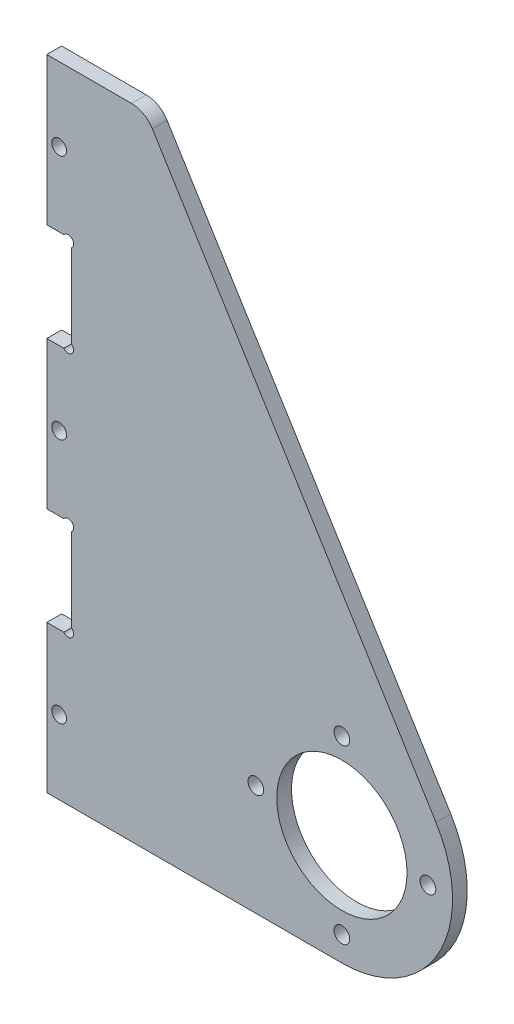
ISO-10303-21;
HEADER;
FILE_DESCRIPTION(('STEP AP214'),'2;1');
FILE_NAME('part.step','',(''),(''),'','','');
FILE_SCHEMA(('AUTOMOTIVE_DESIGN { 1 0 10303 214 1 1 1 1 }'));
ENDSEC;
DATA;
#1=APPLICATION_CONTEXT('core data for automotive mechanical design processes');
#2=APPLICATION_PROTOCOL_DEFINITION('international standard','automotive_design',2000,#1);
#3=PRODUCT_CONTEXT('',#1,'mechanical');
#4=PRODUCT('Part','Part','',(#3));
#5=PRODUCT_RELATED_PRODUCT_CATEGORY('part','',(#4));
#6=PRODUCT_DEFINITION_FORMATION('','',#4);
#7=PRODUCT_DEFINITION_CONTEXT('part definition',#1,'design');
#8=PRODUCT_DEFINITION('design','',#6,#7);
#9=PRODUCT_DEFINITION_SHAPE('','',#8);
#10=(LENGTH_UNIT() NAMED_UNIT(*) SI_UNIT(.MILLI.,.METRE.));
#11=(NAMED_UNIT(*) PLANE_ANGLE_UNIT() SI_UNIT($,.RADIAN.));
#12=(NAMED_UNIT(*) SI_UNIT($,.STERADIAN.) SOLID_ANGLE_UNIT());
#13=UNCERTAINTY_MEASURE_WITH_UNIT(LENGTH_MEASURE(1.E-05),#10,'distance_accuracy_value','');
#14=(GEOMETRIC_REPRESENTATION_CONTEXT(3) GLOBAL_UNCERTAINTY_ASSIGNED_CONTEXT((#13)) GLOBAL_UNIT_ASSIGNED_CONTEXT((#10,
#11,#12)) REPRESENTATION_CONTEXT('',''));
#15=CARTESIAN_POINT('',(0.,0.,0.));
#16=DIRECTION('',(0.,0.,1.));
#17=DIRECTION('',(1.,0.,0.));
#18=AXIS2_PLACEMENT_3D('',#15,#16,#17);
#19=CARTESIAN_POINT('',(-60.,107.5,3.));
#20=DIRECTION('',(1.,0.,0.));
#21=DIRECTION('',(0.,1.,0.));
#22=AXIS2_PLACEMENT_3D('',#19,#20,#21);
#23=PLANE('',#22);
#24=DIRECTION('',(0.,0.,-1.));
#25=VECTOR('',#24,1.);
#26=CARTESIAN_POINT('',(-60.,27.5,3.));
#27=LINE('',#26,#25);
#28=CARTESIAN_POINT('',(-60.,27.5,3.));
#29=VERTEX_POINT('',#28);
#30=CARTESIAN_POINT('',(-60.,27.5,0.));
#31=VERTEX_POINT('',#30);
#32=EDGE_CURVE('E395',#29,#31,#27,.T.);
#33=ORIENTED_EDGE('',*,*,#32,.F.);
#34=DIRECTION('',(0.,-1.,0.));
#35=VECTOR('',#34,1.);
#36=CARTESIAN_POINT('',(-60.,107.5,3.));
#37=LINE('',#36,#35);
#38=CARTESIAN_POINT('',(-60.,57.5,3.));
#39=VERTEX_POINT('',#38);
#40=EDGE_CURVE('E350',#39,#29,#37,.T.);
#41=ORIENTED_EDGE('',*,*,#40,.F.);
#42=DIRECTION('',(0.,0.,-1.));
#43=VECTOR('',#42,1.);
#44=CARTESIAN_POINT('',(-60.,57.5,3.));
#45=LINE('',#44,#43);
#46=CARTESIAN_POINT('',(-60.,57.5,0.));
#47=VERTEX_POINT('',#46);
#48=EDGE_CURVE('E392',#39,#47,#45,.T.);
#49=ORIENTED_EDGE('',*,*,#48,.T.);
#50=DIRECTION('',(0.,-1.,0.));
#51=VECTOR('',#50,1.);
#52=CARTESIAN_POINT('',(-60.,107.5,0.));
#53=LINE('',#52,#51);
#54=EDGE_CURVE('E364',#47,#31,#53,.T.);
#55=ORIENTED_EDGE('',*,*,#54,.T.);
#56=EDGE_LOOP('',(#33,#41,#49,#55));
#57=FACE_BOUND('',#56,.T.);
#58=ADVANCED_FACE('F111',(#57),#23,.F.);
#59=DIRECTION('',(0.,0.,-1.));
#60=VECTOR('',#59,1.);
#61=CARTESIAN_POINT('',(-60.,77.5,3.));
#62=LINE('',#61,#60);
#63=CARTESIAN_POINT('',(-60.,77.5,3.));
#64=VERTEX_POINT('',#63);
#65=CARTESIAN_POINT('',(-60.,77.5,0.));
#66=VERTEX_POINT('',#65);
#67=EDGE_CURVE('E390',#64,#66,#62,.T.);
#68=ORIENTED_EDGE('',*,*,#67,.F.);
#69=CARTESIAN_POINT('',(-60.,107.5,3.));
#70=VERTEX_POINT('',#69);
#71=EDGE_CURVE('E346',#70,#64,#37,.T.);
#72=ORIENTED_EDGE('',*,*,#71,.F.);
#73=DIRECTION('',(0.,0.,-1.));
#74=VECTOR('',#73,1.);
#75=CARTESIAN_POINT('',(-60.,107.5,3.));
#76=LINE('',#75,#74);
#77=CARTESIAN_POINT('',(-60.,107.5,0.));
#78=VERTEX_POINT('',#77);
#79=EDGE_CURVE('E378',#70,#78,#76,.T.);
#80=ORIENTED_EDGE('',*,*,#79,.T.);
#81=EDGE_CURVE('E360',#78,#66,#53,.T.);
#82=ORIENTED_EDGE('',*,*,#81,.T.);
#83=EDGE_LOOP('',(#68,#72,#80,#82));
#84=FACE_BOUND('',#83,.T.);
#85=ADVANCED_FACE('F454',(#84),#23,.F.);
#86=CARTESIAN_POINT('',(0.,0.,3.));
#87=DIRECTION('',(0.,0.,1.));
#88=DIRECTION('',(1.,0.,0.));
#89=AXIS2_PLACEMENT_3D('',#86,#87,#88);
#90=PLANE('',#89);
#91=CARTESIAN_POINT('',(-57.5000000000003,92.5,3.));
#92=DIRECTION('',(0.,0.,1.));
#93=DIRECTION('',(1.,0.,0.));
#94=AXIS2_PLACEMENT_3D('',#91,#92,#93);
#95=CIRCLE('',#94,1.5);
#96=CARTESIAN_POINT('',(-56.0000000000003,92.5,3.));
#97=VERTEX_POINT('',#96);
#98=EDGE_CURVE('E261',#97,#97,#95,.T.);
#99=ORIENTED_EDGE('',*,*,#98,.F.);
#100=EDGE_LOOP('',(#99));
#101=FACE_BOUND('',#100,.T.);
#102=DIRECTION('',(1.,0.,0.));
#103=VECTOR('',#102,1.);
#104=CARTESIAN_POINT('',(-60.,7.5,3.));
#105=LINE('',#104,#103);
#106=CARTESIAN_POINT('',(-60.,7.5,3.));
#107=VERTEX_POINT('',#106);
#108=CARTESIAN_POINT('',(-56.54,7.5,3.));
#109=VERTEX_POINT('',#108);
#110=EDGE_CURVE('E249',#107,#109,#105,.T.);
#111=ORIENTED_EDGE('',*,*,#110,.F.);
#112=CARTESIAN_POINT('',(-60.,-22.5,3.));
#113=VERTEX_POINT('',#112);
#114=EDGE_CURVE('E344',#107,#113,#37,.T.);
#115=ORIENTED_EDGE('',*,*,#114,.T.);
#116=DIRECTION('',(1.,0.,0.));
#117=VECTOR('',#116,1.);
#118=CARTESIAN_POINT('',(-60.,-22.5,3.));
#119=LINE('',#118,#117);
#120=CARTESIAN_POINT('',(0.,-22.5,3.));
#121=VERTEX_POINT('',#120);
#122=EDGE_CURVE('E349',#113,#121,#119,.T.);
#123=ORIENTED_EDGE('',*,*,#122,.T.);
#124=CARTESIAN_POINT('',(0.,0.,3.));
#125=DIRECTION('',(0.,0.,1.));
#126=DIRECTION('',(1.,0.,0.));
#127=AXIS2_PLACEMENT_3D('',#124,#125,#126);
#128=CIRCLE('',#127,22.5);
#129=CARTESIAN_POINT('',(19.1385979441861,11.8306410955111,3.));
#130=VERTEX_POINT('',#129);
#131=EDGE_CURVE('E352',#121,#130,#128,.T.);
#132=ORIENTED_EDGE('',*,*,#131,.T.);
#133=DIRECTION('',(-0.525806270911605,0.850604353074937,0.));
#134=VECTOR('',#133,1.);
#135=CARTESIAN_POINT('',(-40.,107.5,3.));
#136=LINE('',#135,#134);
#137=CARTESIAN_POINT('',(-38.5343712650876,105.129031354558,3.));
#138=VERTEX_POINT('',#137);
#139=EDGE_CURVE('E354',#130,#138,#136,.T.);
#140=ORIENTED_EDGE('',*,*,#139,.T.);
#141=CARTESIAN_POINT('',(-42.7873930304623,102.5,3.));
#142=DIRECTION('',(0.,0.,1.));
#143=DIRECTION('',(1.,0.,0.));
#144=AXIS2_PLACEMENT_3D('',#141,#142,#143);
#145=CIRCLE('',#144,5.);
#146=CARTESIAN_POINT('',(-42.7873930304623,107.5,3.));
#147=VERTEX_POINT('',#146);
#148=EDGE_CURVE('E388',#138,#147,#145,.T.);
#149=ORIENTED_EDGE('',*,*,#148,.T.);
#150=DIRECTION('',(-1.,0.,0.));
#151=VECTOR('',#150,1.);
#152=CARTESIAN_POINT('',(-60.,107.5,3.));
#153=LINE('',#152,#151);
#154=EDGE_CURVE('E342',#147,#70,#153,.T.);
#155=ORIENTED_EDGE('',*,*,#154,.T.);
#156=ORIENTED_EDGE('',*,*,#71,.T.);
#157=DIRECTION('',(1.,0.,0.));
#158=VECTOR('',#157,1.);
#159=CARTESIAN_POINT('',(0.,77.5,3.));
#160=LINE('',#159,#158);
#161=CARTESIAN_POINT('',(-56.5400000000002,77.5,3.));
#162=VERTEX_POINT('',#161);
#163=EDGE_CURVE('E135',#64,#162,#160,.T.);
#164=ORIENTED_EDGE('',*,*,#163,.T.);
#165=CARTESIAN_POINT('',(-55.6600000000002,76.84,3.));
#166=DIRECTION('',(0.,0.,1.));
#167=DIRECTION('',(1.,0.,0.));
#168=AXIS2_PLACEMENT_3D('',#165,#166,#167);
#169=CIRCLE('',#168,1.10000000000001);
#170=CARTESIAN_POINT('',(-55.,75.9600000000001,3.));
#171=VERTEX_POINT('',#170);
#172=EDGE_CURVE('E284',#171,#162,#169,.T.);
#173=ORIENTED_EDGE('',*,*,#172,.F.);
#174=DIRECTION('',(0.,-1.,0.));
#175=VECTOR('',#174,1.);
#176=CARTESIAN_POINT('',(-55.,0.,3.));
#177=LINE('',#176,#175);
#178=CARTESIAN_POINT('',(-55.,59.04,3.));
#179=VERTEX_POINT('',#178);
#180=EDGE_CURVE('E289',#171,#179,#177,.T.);
#181=ORIENTED_EDGE('',*,*,#180,.T.);
#182=CARTESIAN_POINT('',(-55.6600000000001,58.16,3.));
#183=DIRECTION('',(0.,0.,1.));
#184=DIRECTION('',(1.,0.,0.));
#185=AXIS2_PLACEMENT_3D('',#182,#183,#184);
#186=CIRCLE('',#185,1.10000000000001);
#187=CARTESIAN_POINT('',(-56.5400000000001,57.5,3.));
#188=VERTEX_POINT('',#187);
#189=EDGE_CURVE('E281',#188,#179,#186,.T.);
#190=ORIENTED_EDGE('',*,*,#189,.F.);
#191=DIRECTION('',(1.,0.,0.));
#192=VECTOR('',#191,1.);
#193=CARTESIAN_POINT('',(0.,57.5,3.));
#194=LINE('',#193,#192);
#195=EDGE_CURVE('E298',#39,#188,#194,.T.);
#196=ORIENTED_EDGE('',*,*,#195,.F.);
#197=ORIENTED_EDGE('',*,*,#40,.T.);
#198=DIRECTION('',(1.,0.,0.));
#199=VECTOR('',#198,1.);
#200=CARTESIAN_POINT('',(-60.,27.5,3.));
#201=LINE('',#200,#199);
#202=CARTESIAN_POINT('',(-56.54,27.5,3.));
#203=VERTEX_POINT('',#202);
#204=EDGE_CURVE('E127',#29,#203,#201,.T.);
#205=ORIENTED_EDGE('',*,*,#204,.T.);
#206=CARTESIAN_POINT('',(-55.66,26.84,3.));
#207=DIRECTION('',(0.,0.,1.));
#208=DIRECTION('',(1.,0.,0.));
#209=AXIS2_PLACEMENT_3D('',#206,#207,#208);
#210=CIRCLE('',#209,1.1);
#211=CARTESIAN_POINT('',(-55.,25.96,3.));
#212=VERTEX_POINT('',#211);
#213=EDGE_CURVE('E270',#212,#203,#210,.T.);
#214=ORIENTED_EDGE('',*,*,#213,.F.);
#215=DIRECTION('',(0.,-1.,0.));
#216=VECTOR('',#215,1.);
#217=CARTESIAN_POINT('',(-55.,27.5,3.));
#218=LINE('',#217,#216);
#219=CARTESIAN_POINT('',(-55.,9.03999999999999,3.));
#220=VERTEX_POINT('',#219);
#221=EDGE_CURVE('E255',#212,#220,#218,.T.);
#222=ORIENTED_EDGE('',*,*,#221,.T.);
#223=CARTESIAN_POINT('',(-55.66,8.16,3.));
#224=DIRECTION('',(0.,0.,1.));
#225=DIRECTION('',(1.,0.,0.));
#226=AXIS2_PLACEMENT_3D('',#223,#224,#225);
#227=CIRCLE('',#226,1.1);
#228=EDGE_CURVE('E242',#109,#220,#227,.T.);
#229=ORIENTED_EDGE('',*,*,#228,.F.);
#230=EDGE_LOOP('',(#111,#115,#123,#132,#140,#149,#155,#156,#164,#173,#181,#190,#196,#197,#205,
#214,#222,#229));
#231=FACE_BOUND('',#230,.T.);
#232=CARTESIAN_POINT('',(-57.5,-7.50000000000001,3.));
#233=DIRECTION('',(0.,0.,1.));
#234=DIRECTION('',(1.,0.,0.));
#235=AXIS2_PLACEMENT_3D('',#232,#233,#234);
#236=CIRCLE('',#235,1.5);
#237=CARTESIAN_POINT('',(-56.,-7.50000000000001,3.));
#238=VERTEX_POINT('',#237);
#239=EDGE_CURVE('E274',#238,#238,#236,.T.);
#240=ORIENTED_EDGE('',*,*,#239,.F.);
#241=EDGE_LOOP('',(#240));
#242=FACE_BOUND('',#241,.T.);
#243=CARTESIAN_POINT('',(-57.5000000000002,42.5,3.));
#244=DIRECTION('',(0.,0.,1.));
#245=DIRECTION('',(1.,0.,0.));
#246=AXIS2_PLACEMENT_3D('',#243,#244,#245);
#247=CIRCLE('',#246,1.5);
#248=CARTESIAN_POINT('',(-56.0000000000002,42.5,3.));
#249=VERTEX_POINT('',#248);
#250=EDGE_CURVE('E278',#249,#249,#247,.T.);
#251=ORIENTED_EDGE('',*,*,#250,.F.);
#252=EDGE_LOOP('',(#251));
#253=FACE_BOUND('',#252,.T.);
#254=CARTESIAN_POINT('',(0.,-17.5,3.));
#255=DIRECTION('',(0.,0.,1.));
#256=DIRECTION('',(1.,0.,0.));
#257=AXIS2_PLACEMENT_3D('',#254,#255,#256);
#258=CIRCLE('',#257,1.6);
#259=CARTESIAN_POINT('',(1.59999999999994,-17.5,3.));
#260=VERTEX_POINT('',#259);
#261=EDGE_CURVE('E318',#260,#260,#258,.T.);
#262=ORIENTED_EDGE('',*,*,#261,.F.);
#263=EDGE_LOOP('',(#262));
#264=FACE_BOUND('',#263,.T.);
#265=CARTESIAN_POINT('',(0.,17.5,3.));
#266=DIRECTION('',(0.,0.,1.));
#267=DIRECTION('',(1.,0.,0.));
#268=AXIS2_PLACEMENT_3D('',#265,#266,#267);
#269=CIRCLE('',#268,1.6);
#270=CARTESIAN_POINT('',(1.60000000000005,17.5,3.));
#271=VERTEX_POINT('',#270);
#272=EDGE_CURVE('E330',#271,#271,#269,.T.);
#273=ORIENTED_EDGE('',*,*,#272,.F.);
#274=EDGE_LOOP('',(#273));
#275=FACE_BOUND('',#274,.T.);
#276=CARTESIAN_POINT('',(0.,0.,3.));
#277=DIRECTION('',(0.,0.,1.));
#278=DIRECTION('',(1.,0.,0.));
#279=AXIS2_PLACEMENT_3D('',#276,#277,#278);
#280=CIRCLE('',#279,13.25);
#281=CARTESIAN_POINT('',(13.25,0.,3.));
#282=VERTEX_POINT('',#281);
#283=EDGE_CURVE('E336',#282,#282,#280,.T.);
#284=ORIENTED_EDGE('',*,*,#283,.F.);
#285=EDGE_LOOP('',(#284));
#286=FACE_BOUND('',#285,.T.);
#287=CARTESIAN_POINT('',(17.5,0.,3.));
#288=DIRECTION('',(0.,0.,1.));
#289=DIRECTION('',(1.,0.,0.));
#290=AXIS2_PLACEMENT_3D('',#287,#288,#289);
#291=CIRCLE('',#290,1.60000000000001);
#292=CARTESIAN_POINT('',(19.1,0.,3.));
#293=VERTEX_POINT('',#292);
#294=EDGE_CURVE('E324',#293,#293,#291,.T.);
#295=ORIENTED_EDGE('',*,*,#294,.F.);
#296=EDGE_LOOP('',(#295));
#297=FACE_BOUND('',#296,.T.);
#298=CARTESIAN_POINT('',(-17.5,0.,3.));
#299=DIRECTION('',(0.,0.,1.));
#300=DIRECTION('',(1.,0.,0.));
#301=AXIS2_PLACEMENT_3D('',#298,#299,#300);
#302=CIRCLE('',#301,1.6);
#303=CARTESIAN_POINT('',(-15.9,0.,3.));
#304=VERTEX_POINT('',#303);
#305=EDGE_CURVE('E311',#304,#304,#302,.T.);
#306=ORIENTED_EDGE('',*,*,#305,.F.);
#307=EDGE_LOOP('',(#306));
#308=FACE_BOUND('',#307,.T.);
#309=ADVANCED_FACE('F257',(#101,#231,#242,#253,#264,#275,#286,#297,#308),#90,.T.);
#310=CARTESIAN_POINT('',(0.,0.,0.));
#311=DIRECTION('',(0.,0.,1.));
#312=DIRECTION('',(1.,0.,0.));
#313=AXIS2_PLACEMENT_3D('',#310,#311,#312);
#314=PLANE('',#313);
#315=CARTESIAN_POINT('',(-57.5000000000003,92.5,0.));
#316=DIRECTION('',(0.,0.,1.));
#317=DIRECTION('',(1.,0.,0.));
#318=AXIS2_PLACEMENT_3D('',#315,#316,#317);
#319=CIRCLE('',#318,1.5);
#320=CARTESIAN_POINT('',(-56.0000000000003,92.5,0.));
#321=VERTEX_POINT('',#320);
#322=EDGE_CURVE('E115',#321,#321,#319,.T.);
#323=ORIENTED_EDGE('',*,*,#322,.T.);
#324=EDGE_LOOP('',(#323));
#325=FACE_BOUND('',#324,.T.);
#326=CARTESIAN_POINT('',(-57.5,-7.50000000000001,0.));
#327=DIRECTION('',(0.,0.,1.));
#328=DIRECTION('',(1.,0.,0.));
#329=AXIS2_PLACEMENT_3D('',#326,#327,#328);
#330=CIRCLE('',#329,1.5);
#331=CARTESIAN_POINT('',(-56.,-7.50000000000001,0.));
#332=VERTEX_POINT('',#331);
#333=EDGE_CURVE('E409',#332,#332,#330,.T.);
#334=ORIENTED_EDGE('',*,*,#333,.T.);
#335=EDGE_LOOP('',(#334));
#336=FACE_BOUND('',#335,.T.);
#337=CARTESIAN_POINT('',(-57.5000000000002,42.5,0.));
#338=DIRECTION('',(0.,0.,1.));
#339=DIRECTION('',(1.,0.,0.));
#340=AXIS2_PLACEMENT_3D('',#337,#338,#339);
#341=CIRCLE('',#340,1.5);
#342=CARTESIAN_POINT('',(-56.0000000000002,42.5,0.));
#343=VERTEX_POINT('',#342);
#344=EDGE_CURVE('E310',#343,#343,#341,.T.);
#345=ORIENTED_EDGE('',*,*,#344,.T.);
#346=EDGE_LOOP('',(#345));
#347=FACE_BOUND('',#346,.T.);
#348=CARTESIAN_POINT('',(-60.,7.5,0.));
#349=VERTEX_POINT('',#348);
#350=CARTESIAN_POINT('',(-60.,-22.5,0.));
#351=VERTEX_POINT('',#350);
#352=EDGE_CURVE('E359',#349,#351,#53,.T.);
#353=ORIENTED_EDGE('',*,*,#352,.F.);
#354=DIRECTION('',(1.,0.,0.));
#355=VECTOR('',#354,1.);
#356=CARTESIAN_POINT('',(0.,7.50000000000004,0.));
#357=LINE('',#356,#355);
#358=CARTESIAN_POINT('',(-56.54,7.5,0.));
#359=VERTEX_POINT('',#358);
#360=EDGE_CURVE('E308',#349,#359,#357,.T.);
#361=ORIENTED_EDGE('',*,*,#360,.T.);
#362=CARTESIAN_POINT('',(-55.66,8.16,0.));
#363=DIRECTION('',(0.,0.,1.));
#364=DIRECTION('',(1.,0.,0.));
#365=AXIS2_PLACEMENT_3D('',#362,#363,#364);
#366=CIRCLE('',#365,1.1);
#367=CARTESIAN_POINT('',(-55.,9.03999999999999,0.));
#368=VERTEX_POINT('',#367);
#369=EDGE_CURVE('E12',#359,#368,#366,.T.);
#370=ORIENTED_EDGE('',*,*,#369,.T.);
#371=DIRECTION('',(0.,-1.,0.));
#372=VECTOR('',#371,1.);
#373=CARTESIAN_POINT('',(-55.,0.,0.));
#374=LINE('',#373,#372);
#375=CARTESIAN_POINT('',(-55.,25.96,0.));
#376=VERTEX_POINT('',#375);
#377=EDGE_CURVE('E120',#376,#368,#374,.T.);
#378=ORIENTED_EDGE('',*,*,#377,.F.);
#379=CARTESIAN_POINT('',(-55.66,26.84,0.));
#380=DIRECTION('',(0.,0.,1.));
#381=DIRECTION('',(1.,0.,0.));
#382=AXIS2_PLACEMENT_3D('',#379,#380,#381);
#383=CIRCLE('',#382,1.1);
#384=CARTESIAN_POINT('',(-56.54,27.5,0.));
#385=VERTEX_POINT('',#384);
#386=EDGE_CURVE('E406',#376,#385,#383,.T.);
#387=ORIENTED_EDGE('',*,*,#386,.T.);
#388=DIRECTION('',(1.,0.,0.));
#389=VECTOR('',#388,1.);
#390=CARTESIAN_POINT('',(0.,27.5,0.));
#391=LINE('',#390,#389);
#392=EDGE_CURVE('E306',#31,#385,#391,.T.);
#393=ORIENTED_EDGE('',*,*,#392,.F.);
#394=ORIENTED_EDGE('',*,*,#54,.F.);
#395=DIRECTION('',(1.,0.,0.));
#396=VECTOR('',#395,1.);
#397=CARTESIAN_POINT('',(0.,57.5,0.));
#398=LINE('',#397,#396);
#399=CARTESIAN_POINT('',(-56.5400000000001,57.5,0.));
#400=VERTEX_POINT('',#399);
#401=EDGE_CURVE('E303',#47,#400,#398,.T.);
#402=ORIENTED_EDGE('',*,*,#401,.T.);
#403=CARTESIAN_POINT('',(-55.6600000000001,58.16,0.));
#404=DIRECTION('',(0.,0.,1.));
#405=DIRECTION('',(1.,0.,0.));
#406=AXIS2_PLACEMENT_3D('',#403,#404,#405);
#407=CIRCLE('',#406,1.10000000000001);
#408=CARTESIAN_POINT('',(-55.,59.04,0.));
#409=VERTEX_POINT('',#408);
#410=EDGE_CURVE('E403',#400,#409,#407,.T.);
#411=ORIENTED_EDGE('',*,*,#410,.T.);
#412=DIRECTION('',(0.,-1.,0.));
#413=VECTOR('',#412,1.);
#414=CARTESIAN_POINT('',(-55.,0.,0.));
#415=LINE('',#414,#413);
#416=CARTESIAN_POINT('',(-55.,75.9600000000001,0.));
#417=VERTEX_POINT('',#416);
#418=EDGE_CURVE('E401',#417,#409,#415,.T.);
#419=ORIENTED_EDGE('',*,*,#418,.F.);
#420=CARTESIAN_POINT('',(-55.6600000000002,76.84,0.));
#421=DIRECTION('',(0.,0.,1.));
#422=DIRECTION('',(1.,0.,0.));
#423=AXIS2_PLACEMENT_3D('',#420,#421,#422);
#424=CIRCLE('',#423,1.10000000000001);
#425=CARTESIAN_POINT('',(-56.5400000000002,77.5,0.));
#426=VERTEX_POINT('',#425);
#427=EDGE_CURVE('E398',#417,#426,#424,.T.);
#428=ORIENTED_EDGE('',*,*,#427,.T.);
#429=DIRECTION('',(1.,0.,0.));
#430=VECTOR('',#429,1.);
#431=CARTESIAN_POINT('',(0.,77.5,0.));
#432=LINE('',#431,#430);
#433=EDGE_CURVE('E264',#66,#426,#432,.T.);
#434=ORIENTED_EDGE('',*,*,#433,.F.);
#435=ORIENTED_EDGE('',*,*,#81,.F.);
#436=DIRECTION('',(-1.,0.,0.));
#437=VECTOR('',#436,1.);
#438=CARTESIAN_POINT('',(-60.,107.5,0.));
#439=LINE('',#438,#437);
#440=CARTESIAN_POINT('',(-42.7873930304623,107.5,0.));
#441=VERTEX_POINT('',#440);
#442=EDGE_CURVE('E339',#441,#78,#439,.T.);
#443=ORIENTED_EDGE('',*,*,#442,.F.);
#444=CARTESIAN_POINT('',(-42.7873930304623,102.5,0.));
#445=DIRECTION('',(0.,0.,1.));
#446=DIRECTION('',(1.,0.,0.));
#447=AXIS2_PLACEMENT_3D('',#444,#445,#446);
#448=CIRCLE('',#447,5.);
#449=CARTESIAN_POINT('',(-38.5343712650876,105.129031354558,0.));
#450=VERTEX_POINT('',#449);
#451=EDGE_CURVE('E384',#441,#450,#448,.F.);
#452=ORIENTED_EDGE('',*,*,#451,.T.);
#453=DIRECTION('',(-0.525806270911605,0.850604353074937,0.));
#454=VECTOR('',#453,1.);
#455=CARTESIAN_POINT('',(-40.,107.5,0.));
#456=LINE('',#455,#454);
#457=CARTESIAN_POINT('',(19.1385979441861,11.8306410955111,0.));
#458=VERTEX_POINT('',#457);
#459=EDGE_CURVE('E345',#458,#450,#456,.T.);
#460=ORIENTED_EDGE('',*,*,#459,.F.);
#461=CARTESIAN_POINT('',(0.,0.,0.));
#462=DIRECTION('',(0.,0.,1.));
#463=DIRECTION('',(1.,0.,0.));
#464=AXIS2_PLACEMENT_3D('',#461,#462,#463);
#465=CIRCLE('',#464,22.5);
#466=CARTESIAN_POINT('',(0.,-22.5,0.));
#467=VERTEX_POINT('',#466);
#468=EDGE_CURVE('E366',#467,#458,#465,.T.);
#469=ORIENTED_EDGE('',*,*,#468,.F.);
#470=DIRECTION('',(1.,0.,0.));
#471=VECTOR('',#470,1.);
#472=CARTESIAN_POINT('',(-40.,-22.5,0.));
#473=LINE('',#472,#471);
#474=EDGE_CURVE('E363',#351,#467,#473,.T.);
#475=ORIENTED_EDGE('',*,*,#474,.F.);
#476=EDGE_LOOP('',(#353,#361,#370,#378,#387,#393,#394,#402,#411,#419,#428,#434,#435,#443,#452,
#460,#469,#475));
#477=FACE_BOUND('',#476,.T.);
#478=CARTESIAN_POINT('',(0.,0.,0.));
#479=DIRECTION('',(0.,0.,1.));
#480=DIRECTION('',(1.,0.,0.));
#481=AXIS2_PLACEMENT_3D('',#478,#479,#480);
#482=CIRCLE('',#481,13.25);
#483=CARTESIAN_POINT('',(13.25,0.,0.));
#484=VERTEX_POINT('',#483);
#485=EDGE_CURVE('E333',#484,#484,#482,.T.);
#486=ORIENTED_EDGE('',*,*,#485,.T.);
#487=EDGE_LOOP('',(#486));
#488=FACE_BOUND('',#487,.T.);
#489=CARTESIAN_POINT('',(0.,17.5,0.));
#490=DIRECTION('',(0.,0.,1.));
#491=DIRECTION('',(1.,0.,0.));
#492=AXIS2_PLACEMENT_3D('',#489,#490,#491);
#493=CIRCLE('',#492,1.6);
#494=CARTESIAN_POINT('',(1.60000000000005,17.5,0.));
#495=VERTEX_POINT('',#494);
#496=EDGE_CURVE('E327',#495,#495,#493,.T.);
#497=ORIENTED_EDGE('',*,*,#496,.T.);
#498=EDGE_LOOP('',(#497));
#499=FACE_BOUND('',#498,.T.);
#500=CARTESIAN_POINT('',(17.5,0.,0.));
#501=DIRECTION('',(0.,0.,1.));
#502=DIRECTION('',(1.,0.,0.));
#503=AXIS2_PLACEMENT_3D('',#500,#501,#502);
#504=CIRCLE('',#503,1.60000000000001);
#505=CARTESIAN_POINT('',(19.1,0.,0.));
#506=VERTEX_POINT('',#505);
#507=EDGE_CURVE('E321',#506,#506,#504,.T.);
#508=ORIENTED_EDGE('',*,*,#507,.T.);
#509=EDGE_LOOP('',(#508));
#510=FACE_BOUND('',#509,.T.);
#511=CARTESIAN_POINT('',(0.,-17.5,0.));
#512=DIRECTION('',(0.,0.,1.));
#513=DIRECTION('',(1.,0.,0.));
#514=AXIS2_PLACEMENT_3D('',#511,#512,#513);
#515=CIRCLE('',#514,1.6);
#516=CARTESIAN_POINT('',(1.59999999999994,-17.5,0.));
#517=VERTEX_POINT('',#516);
#518=EDGE_CURVE('E314',#517,#517,#515,.T.);
#519=ORIENTED_EDGE('',*,*,#518,.T.);
#520=EDGE_LOOP('',(#519));
#521=FACE_BOUND('',#520,.T.);
#522=CARTESIAN_POINT('',(-17.5,0.,0.));
#523=DIRECTION('',(0.,0.,1.));
#524=DIRECTION('',(1.,0.,0.));
#525=AXIS2_PLACEMENT_3D('',#522,#523,#524);
#526=CIRCLE('',#525,1.6);
#527=CARTESIAN_POINT('',(-15.9,0.,0.));
#528=VERTEX_POINT('',#527);
#529=EDGE_CURVE('E315',#528,#528,#526,.T.);
#530=ORIENTED_EDGE('',*,*,#529,.T.);
#531=EDGE_LOOP('',(#530));
#532=FACE_BOUND('',#531,.T.);
#533=ADVANCED_FACE('F420',(#325,#336,#347,#477,#488,#499,#510,#521,#532),#314,.F.);
#534=CARTESIAN_POINT('',(-60.,107.5,3.));
#535=DIRECTION('',(0.,-1.,0.));
#536=DIRECTION('',(0.,0.,-1.));
#537=AXIS2_PLACEMENT_3D('',#534,#535,#536);
#538=PLANE('',#537);
#539=ORIENTED_EDGE('',*,*,#154,.F.);
#540=DIRECTION('',(0.,0.,-1.));
#541=VECTOR('',#540,1.);
#542=CARTESIAN_POINT('',(-42.7873930304623,107.5,3.));
#543=LINE('',#542,#541);
#544=EDGE_CURVE('E381',#147,#441,#543,.T.);
#545=ORIENTED_EDGE('',*,*,#544,.T.);
#546=ORIENTED_EDGE('',*,*,#442,.T.);
#547=ORIENTED_EDGE('',*,*,#79,.F.);
#548=EDGE_LOOP('',(#539,#545,#546,#547));
#549=FACE_BOUND('',#548,.T.);
#550=ADVANCED_FACE('F464',(#549),#538,.F.);
#551=ORIENTED_EDGE('',*,*,#114,.F.);
#552=DIRECTION('',(0.,0.,-1.));
#553=VECTOR('',#552,1.);
#554=CARTESIAN_POINT('',(-60.,7.50000000000001,3.));
#555=LINE('',#554,#553);
#556=EDGE_CURVE('E252',#107,#349,#555,.T.);
#557=ORIENTED_EDGE('',*,*,#556,.T.);
#558=ORIENTED_EDGE('',*,*,#352,.T.);
#559=DIRECTION('',(0.,0.,-1.));
#560=VECTOR('',#559,1.);
#561=CARTESIAN_POINT('',(-60.,-22.5,3.));
#562=LINE('',#561,#560);
#563=EDGE_CURVE('E375',#113,#351,#562,.T.);
#564=ORIENTED_EDGE('',*,*,#563,.F.);
#565=EDGE_LOOP('',(#551,#557,#558,#564));
#566=FACE_BOUND('',#565,.T.);
#567=ADVANCED_FACE('F424',(#566),#23,.F.);
#568=CARTESIAN_POINT('',(-40.,-22.5,3.));
#569=DIRECTION('',(0.,1.,0.));
#570=DIRECTION('',(0.,0.,1.));
#571=AXIS2_PLACEMENT_3D('',#568,#569,#570);
#572=PLANE('',#571);
#573=ORIENTED_EDGE('',*,*,#474,.T.);
#574=DIRECTION('',(0.,0.,-1.));
#575=VECTOR('',#574,1.);
#576=CARTESIAN_POINT('',(0.,-22.5,3.));
#577=LINE('',#576,#575);
#578=EDGE_CURVE('E372',#121,#467,#577,.T.);
#579=ORIENTED_EDGE('',*,*,#578,.F.);
#580=ORIENTED_EDGE('',*,*,#122,.F.);
#581=ORIENTED_EDGE('',*,*,#563,.T.);
#582=EDGE_LOOP('',(#573,#579,#580,#581));
#583=FACE_BOUND('',#582,.T.);
#584=ADVANCED_FACE('F463',(#583),#572,.F.);
#585=CARTESIAN_POINT('',(0.,0.,3.));
#586=DIRECTION('',(0.,0.,-1.));
#587=DIRECTION('',(-1.,0.,0.));
#588=AXIS2_PLACEMENT_3D('',#585,#586,#587);
#589=CYLINDRICAL_SURFACE('',#588,22.5);
#590=ORIENTED_EDGE('',*,*,#468,.T.);
#591=DIRECTION('',(0.,0.,-1.));
#592=VECTOR('',#591,1.);
#593=CARTESIAN_POINT('',(19.1385979441861,11.8306410955111,3.));
#594=LINE('',#593,#592);
#595=EDGE_CURVE('E357',#130,#458,#594,.T.);
#596=ORIENTED_EDGE('',*,*,#595,.F.);
#597=ORIENTED_EDGE('',*,*,#131,.F.);
#598=ORIENTED_EDGE('',*,*,#578,.T.);
#599=EDGE_LOOP('',(#590,#596,#597,#598));
#600=FACE_BOUND('',#599,.T.);
#601=ADVANCED_FACE('F470',(#600),#589,.T.);
#602=CARTESIAN_POINT('',(-40.,107.5,3.));
#603=DIRECTION('',(-0.850604353074937,-0.525806270911604,0.));
#604=DIRECTION('',(0.525806270911605,-0.850604353074937,0.));
#605=AXIS2_PLACEMENT_3D('',#602,#603,#604);
#606=PLANE('',#605);
#607=ORIENTED_EDGE('',*,*,#459,.T.);
#608=DIRECTION('',(0.,0.,-1.));
#609=VECTOR('',#608,1.);
#610=CARTESIAN_POINT('',(-38.5343712650876,105.129031354558,3.));
#611=LINE('',#610,#609);
#612=EDGE_CURVE('E386',#450,#138,#611,.F.);
#613=ORIENTED_EDGE('',*,*,#612,.T.);
#614=ORIENTED_EDGE('',*,*,#139,.F.);
#615=ORIENTED_EDGE('',*,*,#595,.T.);
#616=EDGE_LOOP('',(#607,#613,#614,#615));
#617=FACE_BOUND('',#616,.T.);
#618=ADVANCED_FACE('F492',(#617),#606,.F.);
#619=CARTESIAN_POINT('',(0.,0.,3.));
#620=DIRECTION('',(0.,0.,-1.));
#621=DIRECTION('',(-1.,0.,0.));
#622=AXIS2_PLACEMENT_3D('',#619,#620,#621);
#623=CYLINDRICAL_SURFACE('',#622,13.25);
#624=ORIENTED_EDGE('',*,*,#283,.T.);
#625=EDGE_LOOP('',(#624));
#626=FACE_BOUND('',#625,.T.);
#627=ORIENTED_EDGE('',*,*,#485,.F.);
#628=EDGE_LOOP('',(#627));
#629=FACE_BOUND('',#628,.T.);
#630=ADVANCED_FACE('F503',(#626,#629),#623,.F.);
#631=CARTESIAN_POINT('',(0.,17.5,3.));
#632=DIRECTION('',(0.,0.,-1.));
#633=DIRECTION('',(-1.,0.,0.));
#634=AXIS2_PLACEMENT_3D('',#631,#632,#633);
#635=CYLINDRICAL_SURFACE('',#634,1.6);
#636=ORIENTED_EDGE('',*,*,#272,.T.);
#637=EDGE_LOOP('',(#636));
#638=FACE_BOUND('',#637,.T.);
#639=ORIENTED_EDGE('',*,*,#496,.F.);
#640=EDGE_LOOP('',(#639));
#641=FACE_BOUND('',#640,.T.);
#642=ADVANCED_FACE('F510',(#638,#641),#635,.F.);
#643=CARTESIAN_POINT('',(17.5,0.,3.));
#644=DIRECTION('',(0.,0.,-1.));
#645=DIRECTION('',(-1.,0.,0.));
#646=AXIS2_PLACEMENT_3D('',#643,#644,#645);
#647=CYLINDRICAL_SURFACE('',#646,1.60000000000001);
#648=ORIENTED_EDGE('',*,*,#294,.T.);
#649=EDGE_LOOP('',(#648));
#650=FACE_BOUND('',#649,.T.);
#651=ORIENTED_EDGE('',*,*,#507,.F.);
#652=EDGE_LOOP('',(#651));
#653=FACE_BOUND('',#652,.T.);
#654=ADVANCED_FACE('F514',(#650,#653),#647,.F.);
#655=CARTESIAN_POINT('',(0.,-17.5,3.));
#656=DIRECTION('',(0.,0.,-1.));
#657=DIRECTION('',(-1.,0.,0.));
#658=AXIS2_PLACEMENT_3D('',#655,#656,#657);
#659=CYLINDRICAL_SURFACE('',#658,1.6);
#660=ORIENTED_EDGE('',*,*,#261,.T.);
#661=EDGE_LOOP('',(#660));
#662=FACE_BOUND('',#661,.T.);
#663=ORIENTED_EDGE('',*,*,#518,.F.);
#664=EDGE_LOOP('',(#663));
#665=FACE_BOUND('',#664,.T.);
#666=ADVANCED_FACE('F518',(#662,#665),#659,.F.);
#667=CARTESIAN_POINT('',(-17.5,0.,3.));
#668=DIRECTION('',(0.,0.,-1.));
#669=DIRECTION('',(-1.,0.,0.));
#670=AXIS2_PLACEMENT_3D('',#667,#668,#669);
#671=CYLINDRICAL_SURFACE('',#670,1.6);
#672=ORIENTED_EDGE('',*,*,#305,.T.);
#673=EDGE_LOOP('',(#672));
#674=FACE_BOUND('',#673,.T.);
#675=ORIENTED_EDGE('',*,*,#529,.F.);
#676=EDGE_LOOP('',(#675));
#677=FACE_BOUND('',#676,.T.);
#678=ADVANCED_FACE('F522',(#674,#677),#671,.F.);
#679=CARTESIAN_POINT('',(-42.7873930304623,102.5,3.));
#680=DIRECTION('',(0.,0.,-1.));
#681=DIRECTION('',(-1.,0.,0.));
#682=AXIS2_PLACEMENT_3D('',#679,#680,#681);
#683=CYLINDRICAL_SURFACE('',#682,5.);
#684=ORIENTED_EDGE('',*,*,#148,.F.);
#685=ORIENTED_EDGE('',*,*,#612,.F.);
#686=ORIENTED_EDGE('',*,*,#451,.F.);
#687=ORIENTED_EDGE('',*,*,#544,.F.);
#688=EDGE_LOOP('',(#684,#685,#686,#687));
#689=FACE_BOUND('',#688,.T.);
#690=ADVANCED_FACE('F113',(#689),#683,.T.);
#691=CARTESIAN_POINT('',(-55.,0.,-7.));
#692=DIRECTION('',(-1.,0.,0.));
#693=DIRECTION('',(0.,-1.,0.));
#694=AXIS2_PLACEMENT_3D('',#691,#692,#693);
#695=PLANE('',#694);
#696=ORIENTED_EDGE('',*,*,#418,.T.);
#697=DIRECTION('',(0.,0.,1.));
#698=VECTOR('',#697,1.);
#699=CARTESIAN_POINT('',(-55.,59.04,-7.));
#700=LINE('',#699,#698);
#701=EDGE_CURVE('E292',#409,#179,#700,.T.);
#702=ORIENTED_EDGE('',*,*,#701,.T.);
#703=ORIENTED_EDGE('',*,*,#180,.F.);
#704=DIRECTION('',(0.,0.,1.));
#705=VECTOR('',#704,1.);
#706=CARTESIAN_POINT('',(-55.,75.9600000000001,-7.));
#707=LINE('',#706,#705);
#708=EDGE_CURVE('E294',#417,#171,#707,.T.);
#709=ORIENTED_EDGE('',*,*,#708,.F.);
#710=EDGE_LOOP('',(#696,#702,#703,#709));
#711=FACE_BOUND('',#710,.T.);
#712=ADVANCED_FACE('F526',(#711),#695,.T.);
#713=CARTESIAN_POINT('',(-55.6600000000001,58.16,-7.));
#714=DIRECTION('',(0.,0.,1.));
#715=DIRECTION('',(1.,0.,0.));
#716=AXIS2_PLACEMENT_3D('',#713,#714,#715);
#717=CYLINDRICAL_SURFACE('',#716,1.10000000000001);
#718=DIRECTION('',(0.,0.,1.));
#719=VECTOR('',#718,1.);
#720=CARTESIAN_POINT('',(-56.5400000000001,57.5,-7.));
#721=LINE('',#720,#719);
#722=EDGE_CURVE('E290',#400,#188,#721,.T.);
#723=ORIENTED_EDGE('',*,*,#722,.T.);
#724=ORIENTED_EDGE('',*,*,#189,.T.);
#725=ORIENTED_EDGE('',*,*,#701,.F.);
#726=ORIENTED_EDGE('',*,*,#410,.F.);
#727=EDGE_LOOP('',(#723,#724,#725,#726));
#728=FACE_BOUND('',#727,.T.);
#729=ADVANCED_FACE('F528',(#728),#717,.F.);
#730=CARTESIAN_POINT('',(-55.6600000000002,76.84,-7.));
#731=DIRECTION('',(0.,0.,1.));
#732=DIRECTION('',(1.,0.,0.));
#733=AXIS2_PLACEMENT_3D('',#730,#731,#732);
#734=CYLINDRICAL_SURFACE('',#733,1.10000000000001);
#735=ORIENTED_EDGE('',*,*,#708,.T.);
#736=ORIENTED_EDGE('',*,*,#172,.T.);
#737=DIRECTION('',(0.,0.,1.));
#738=VECTOR('',#737,1.);
#739=CARTESIAN_POINT('',(-56.5400000000002,77.5,-7.));
#740=LINE('',#739,#738);
#741=EDGE_CURVE('E287',#426,#162,#740,.T.);
#742=ORIENTED_EDGE('',*,*,#741,.F.);
#743=ORIENTED_EDGE('',*,*,#427,.F.);
#744=EDGE_LOOP('',(#735,#736,#742,#743));
#745=FACE_BOUND('',#744,.T.);
#746=ADVANCED_FACE('F531',(#745),#734,.F.);
#747=CARTESIAN_POINT('',(0.,57.5,-7.));
#748=DIRECTION('',(0.,-1.,0.));
#749=DIRECTION('',(0.,0.,-1.));
#750=AXIS2_PLACEMENT_3D('',#747,#748,#749);
#751=PLANE('',#750);
#752=ORIENTED_EDGE('',*,*,#48,.F.);
#753=ORIENTED_EDGE('',*,*,#195,.T.);
#754=ORIENTED_EDGE('',*,*,#722,.F.);
#755=ORIENTED_EDGE('',*,*,#401,.F.);
#756=EDGE_LOOP('',(#752,#753,#754,#755));
#757=FACE_BOUND('',#756,.T.);
#758=ADVANCED_FACE('F449',(#757),#751,.F.);
#759=CARTESIAN_POINT('',(0.,77.5,-7.));
#760=DIRECTION('',(0.,-1.,0.));
#761=DIRECTION('',(0.,0.,-1.));
#762=AXIS2_PLACEMENT_3D('',#759,#760,#761);
#763=PLANE('',#762);
#764=ORIENTED_EDGE('',*,*,#433,.T.);
#765=ORIENTED_EDGE('',*,*,#741,.T.);
#766=ORIENTED_EDGE('',*,*,#163,.F.);
#767=ORIENTED_EDGE('',*,*,#67,.T.);
#768=EDGE_LOOP('',(#764,#765,#766,#767));
#769=FACE_BOUND('',#768,.T.);
#770=ADVANCED_FACE('F442',(#769),#763,.T.);
#771=CARTESIAN_POINT('',(-55.66,26.84,-7.));
#772=DIRECTION('',(0.,0.,1.));
#773=DIRECTION('',(1.,0.,0.));
#774=AXIS2_PLACEMENT_3D('',#771,#772,#773);
#775=CYLINDRICAL_SURFACE('',#774,1.1);
#776=DIRECTION('',(0.,0.,1.));
#777=VECTOR('',#776,1.);
#778=CARTESIAN_POINT('',(-55.,25.96,-7.));
#779=LINE('',#778,#777);
#780=EDGE_CURVE('E273',#212,#376,#779,.F.);
#781=ORIENTED_EDGE('',*,*,#780,.F.);
#782=ORIENTED_EDGE('',*,*,#213,.T.);
#783=DIRECTION('',(0.,0.,1.));
#784=VECTOR('',#783,1.);
#785=CARTESIAN_POINT('',(-56.54,27.5,-7.));
#786=LINE('',#785,#784);
#787=EDGE_CURVE('E277',#385,#203,#786,.T.);
#788=ORIENTED_EDGE('',*,*,#787,.F.);
#789=ORIENTED_EDGE('',*,*,#386,.F.);
#790=EDGE_LOOP('',(#781,#782,#788,#789));
#791=FACE_BOUND('',#790,.T.);
#792=ADVANCED_FACE('F438',(#791),#775,.F.);
#793=CARTESIAN_POINT('',(-55.66,8.16,-7.));
#794=DIRECTION('',(0.,0.,1.));
#795=DIRECTION('',(1.,0.,0.));
#796=AXIS2_PLACEMENT_3D('',#793,#794,#795);
#797=CYLINDRICAL_SURFACE('',#796,1.1);
#798=DIRECTION('',(0.,0.,1.));
#799=VECTOR('',#798,1.);
#800=CARTESIAN_POINT('',(-56.54,7.5,-7.));
#801=LINE('',#800,#799);
#802=EDGE_CURVE('E237',#109,#359,#801,.F.);
#803=ORIENTED_EDGE('',*,*,#802,.F.);
#804=ORIENTED_EDGE('',*,*,#228,.T.);
#805=DIRECTION('',(0.,0.,1.));
#806=VECTOR('',#805,1.);
#807=CARTESIAN_POINT('',(-55.,9.03999999999999,-7.));
#808=LINE('',#807,#806);
#809=EDGE_CURVE('E246',#220,#368,#808,.F.);
#810=ORIENTED_EDGE('',*,*,#809,.T.);
#811=ORIENTED_EDGE('',*,*,#369,.F.);
#812=EDGE_LOOP('',(#803,#804,#810,#811));
#813=FACE_BOUND('',#812,.T.);
#814=ADVANCED_FACE('F239',(#813),#797,.F.);
#815=CARTESIAN_POINT('',(-55.,27.5,-7.));
#816=DIRECTION('',(-1.,0.,0.));
#817=DIRECTION('',(0.,-1.,0.));
#818=AXIS2_PLACEMENT_3D('',#815,#816,#817);
#819=PLANE('',#818);
#820=ORIENTED_EDGE('',*,*,#377,.T.);
#821=ORIENTED_EDGE('',*,*,#809,.F.);
#822=ORIENTED_EDGE('',*,*,#221,.F.);
#823=ORIENTED_EDGE('',*,*,#780,.T.);
#824=EDGE_LOOP('',(#820,#821,#822,#823));
#825=FACE_BOUND('',#824,.T.);
#826=ADVANCED_FACE('F417',(#825),#819,.T.);
#827=CARTESIAN_POINT('',(-60.,7.5,-7.));
#828=DIRECTION('',(0.,-1.,0.));
#829=DIRECTION('',(1.,0.,0.));
#830=AXIS2_PLACEMENT_3D('',#827,#828,#829);
#831=PLANE('',#830);
#832=ORIENTED_EDGE('',*,*,#556,.F.);
#833=ORIENTED_EDGE('',*,*,#110,.T.);
#834=ORIENTED_EDGE('',*,*,#802,.T.);
#835=ORIENTED_EDGE('',*,*,#360,.F.);
#836=EDGE_LOOP('',(#832,#833,#834,#835));
#837=FACE_BOUND('',#836,.T.);
#838=ADVANCED_FACE('F250',(#837),#831,.F.);
#839=CARTESIAN_POINT('',(-60.,27.5,-7.));
#840=DIRECTION('',(0.,-1.,0.));
#841=DIRECTION('',(0.,0.,-1.));
#842=AXIS2_PLACEMENT_3D('',#839,#840,#841);
#843=PLANE('',#842);
#844=ORIENTED_EDGE('',*,*,#392,.T.);
#845=ORIENTED_EDGE('',*,*,#787,.T.);
#846=ORIENTED_EDGE('',*,*,#204,.F.);
#847=ORIENTED_EDGE('',*,*,#32,.T.);
#848=EDGE_LOOP('',(#844,#845,#846,#847));
#849=FACE_BOUND('',#848,.T.);
#850=ADVANCED_FACE('F435',(#849),#843,.T.);
#851=CARTESIAN_POINT('',(-57.5000000000002,42.5,-7.));
#852=DIRECTION('',(0.,0.,1.));
#853=DIRECTION('',(1.,0.,0.));
#854=AXIS2_PLACEMENT_3D('',#851,#852,#853);
#855=CYLINDRICAL_SURFACE('',#854,1.5);
#856=ORIENTED_EDGE('',*,*,#250,.T.);
#857=EDGE_LOOP('',(#856));
#858=FACE_BOUND('',#857,.T.);
#859=ORIENTED_EDGE('',*,*,#344,.F.);
#860=EDGE_LOOP('',(#859));
#861=FACE_BOUND('',#860,.T.);
#862=ADVANCED_FACE('F540',(#858,#861),#855,.F.);
#863=CARTESIAN_POINT('',(-57.5,-7.50000000000001,-7.));
#864=DIRECTION('',(0.,0.,1.));
#865=DIRECTION('',(1.,0.,0.));
#866=AXIS2_PLACEMENT_3D('',#863,#864,#865);
#867=CYLINDRICAL_SURFACE('',#866,1.5);
#868=ORIENTED_EDGE('',*,*,#239,.T.);
#869=EDGE_LOOP('',(#868));
#870=FACE_BOUND('',#869,.T.);
#871=ORIENTED_EDGE('',*,*,#333,.F.);
#872=EDGE_LOOP('',(#871));
#873=FACE_BOUND('',#872,.T.);
#874=ADVANCED_FACE('F542',(#870,#873),#867,.F.);
#875=CARTESIAN_POINT('',(-57.5000000000003,92.5,-7.));
#876=DIRECTION('',(0.,0.,1.));
#877=DIRECTION('',(1.,0.,0.));
#878=AXIS2_PLACEMENT_3D('',#875,#876,#877);
#879=CYLINDRICAL_SURFACE('',#878,1.5);
#880=ORIENTED_EDGE('',*,*,#98,.T.);
#881=EDGE_LOOP('',(#880));
#882=FACE_BOUND('',#881,.T.);
#883=ORIENTED_EDGE('',*,*,#322,.F.);
#884=EDGE_LOOP('',(#883));
#885=FACE_BOUND('',#884,.T.);
#886=ADVANCED_FACE('F545',(#882,#885),#879,.F.);
#887=CLOSED_SHELL('',(#58,#85,#309,#533,#550,#567,#584,#601,#618,#630,#642,#654,#666,#678,#690,
#712,#729,#746,#758,#770,#792,#814,#826,#838,#850,#862,#874,#886));
#888=MANIFOLD_SOLID_BREP('B2',#887);
#889=ADVANCED_BREP_SHAPE_REPRESENTATION('',(#18,#888),#14);
#890=SHAPE_DEFINITION_REPRESENTATION(#9,#889);
ENDSEC;
END-ISO-10303-21;
